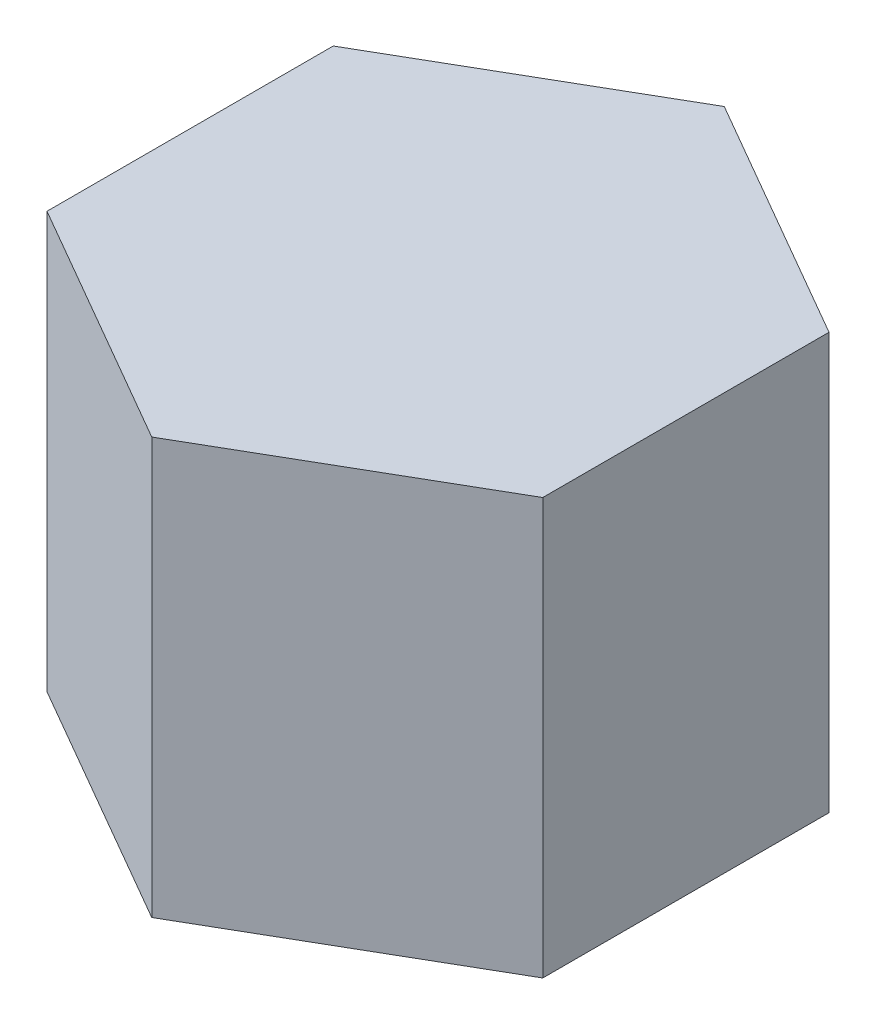
ISO-10303-21;
HEADER;
FILE_DESCRIPTION(('STEP AP214'),'2;1');
FILE_NAME('part.step','',(''),(''),'','','');
FILE_SCHEMA(('AUTOMOTIVE_DESIGN { 1 0 10303 214 1 1 1 1 }'));
ENDSEC;
DATA;
#1=APPLICATION_CONTEXT('core data for automotive mechanical design processes');
#2=APPLICATION_PROTOCOL_DEFINITION('international standard','automotive_design',2000,#1);
#3=PRODUCT_CONTEXT('',#1,'mechanical');
#4=PRODUCT('Part','Part','',(#3));
#5=PRODUCT_RELATED_PRODUCT_CATEGORY('part','',(#4));
#6=PRODUCT_DEFINITION_FORMATION('','',#4);
#7=PRODUCT_DEFINITION_CONTEXT('part definition',#1,'design');
#8=PRODUCT_DEFINITION('design','',#6,#7);
#9=PRODUCT_DEFINITION_SHAPE('','',#8);
#10=(LENGTH_UNIT() NAMED_UNIT(*) SI_UNIT(.MILLI.,.METRE.));
#11=(NAMED_UNIT(*) PLANE_ANGLE_UNIT() SI_UNIT($,.RADIAN.));
#12=(NAMED_UNIT(*) SI_UNIT($,.STERADIAN.) SOLID_ANGLE_UNIT());
#13=UNCERTAINTY_MEASURE_WITH_UNIT(LENGTH_MEASURE(1.E-05),#10,'distance_accuracy_value','');
#14=(GEOMETRIC_REPRESENTATION_CONTEXT(3) GLOBAL_UNCERTAINTY_ASSIGNED_CONTEXT((#13)) GLOBAL_UNIT_ASSIGNED_CONTEXT((#10,
#11,#12)) REPRESENTATION_CONTEXT('',''));
#15=CARTESIAN_POINT('',(0.,0.,0.));
#16=DIRECTION('',(0.,0.,1.));
#17=DIRECTION('',(1.,0.,0.));
#18=AXIS2_PLACEMENT_3D('',#15,#16,#17);
#19=CARTESIAN_POINT('',(203.839551417382,-147.556598747966,290.81594581671));
#20=DIRECTION('',(-0.500000000000096,0.,-0.866025403784383));
#21=DIRECTION('',(-0.866025403784383,0.,0.500000000000096));
#22=AXIS2_PLACEMENT_3D('',#19,#20,#21);
#23=PLANE('',#22);
#24=CARTESIAN_POINT('',(204.142660308706,-147.047793579175,290.64094581671));
#25=DIRECTION('',(-0.866025403784383,0.,0.500000000000096));
#26=VECTOR('',#25,1.);
#27=LINE('',#24,#26);
#28=CARTESIAN_POINT('',(204.142660308706,-147.047793579175,290.64094581671));
#29=VERTEX_POINT('',#28);
#30=CARTESIAN_POINT('',(203.839551417382,-147.047793579175,290.81594581671));
#31=VERTEX_POINT('',#30);
#32=EDGE_CURVE('E170',#29,#31,#27,.T.);
#33=ORIENTED_EDGE('',*,*,#32,.T.);
#34=CARTESIAN_POINT('',(203.839551417382,-147.556598747966,290.81594581671));
#35=DIRECTION('',(0.,1.,0.));
#36=VECTOR('',#35,1.);
#37=LINE('',#34,#36);
#38=CARTESIAN_POINT('',(203.839551417382,-147.556598747966,290.81594581671));
#39=VERTEX_POINT('',#38);
#40=EDGE_CURVE('E35',#39,#31,#37,.T.);
#41=ORIENTED_EDGE('',*,*,#40,.F.);
#42=CARTESIAN_POINT('',(204.142660308706,-147.556598747966,290.64094581671));
#43=DIRECTION('',(-0.866025403784383,0.,0.500000000000096));
#44=VECTOR('',#43,1.);
#45=LINE('',#42,#44);
#46=CARTESIAN_POINT('',(204.142660308706,-147.556598747966,290.64094581671));
#47=VERTEX_POINT('',#46);
#48=EDGE_CURVE('E159',#47,#39,#45,.T.);
#49=ORIENTED_EDGE('',*,*,#48,.F.);
#50=CARTESIAN_POINT('',(204.142660308706,-147.556598747966,290.64094581671));
#51=DIRECTION('',(0.,1.,0.));
#52=VECTOR('',#51,1.);
#53=LINE('',#50,#52);
#54=EDGE_CURVE('E10',#47,#29,#53,.T.);
#55=ORIENTED_EDGE('',*,*,#54,.T.);
#56=EDGE_LOOP('',(#33,#41,#49,#55));
#57=FACE_BOUND('',#56,.T.);
#58=ADVANCED_FACE('F16',(#57),#23,.F.);
#59=CARTESIAN_POINT('',(204.142660308706,-147.556598747966,291.594471220494));
#60=DIRECTION('',(-1.,0.,0.));
#61=DIRECTION('',(0.,-1.,0.));
#62=AXIS2_PLACEMENT_3D('',#59,#60,#61);
#63=PLANE('',#62);
#64=CARTESIAN_POINT('',(204.142660308706,-147.047793579175,290.29094581671));
#65=DIRECTION('',(0.,0.,1.));
#66=VECTOR('',#65,1.);
#67=LINE('',#64,#66);
#68=CARTESIAN_POINT('',(204.142660308706,-147.047793579175,290.29094581671));
#69=VERTEX_POINT('',#68);
#70=EDGE_CURVE('E167',#69,#29,#67,.T.);
#71=ORIENTED_EDGE('',*,*,#70,.T.);
#72=ORIENTED_EDGE('',*,*,#54,.F.);
#73=CARTESIAN_POINT('',(204.142660308706,-147.556598747966,290.29094581671));
#74=DIRECTION('',(0.,0.,1.));
#75=VECTOR('',#74,1.);
#76=LINE('',#73,#75);
#77=CARTESIAN_POINT('',(204.142660308706,-147.556598747966,290.29094581671));
#78=VERTEX_POINT('',#77);
#79=EDGE_CURVE('E156',#78,#47,#76,.T.);
#80=ORIENTED_EDGE('',*,*,#79,.F.);
#81=CARTESIAN_POINT('',(204.142660308706,-147.556598747966,290.29094581671));
#82=DIRECTION('',(0.,1.,0.));
#83=VECTOR('',#82,1.);
#84=LINE('',#81,#83);
#85=EDGE_CURVE('E27',#78,#69,#84,.T.);
#86=ORIENTED_EDGE('',*,*,#85,.T.);
#87=EDGE_LOOP('',(#71,#72,#80,#86));
#88=FACE_BOUND('',#87,.T.);
#89=ADVANCED_FACE('F189',(#88),#63,.F.);
#90=CARTESIAN_POINT('',(204.142660308706,-147.556598747966,290.29094581671));
#91=DIRECTION('',(-0.500000000000028,0.,0.866025403784422));
#92=DIRECTION('',(0.866025403784423,0.,0.500000000000028));
#93=AXIS2_PLACEMENT_3D('',#90,#91,#92);
#94=PLANE('',#93);
#95=CARTESIAN_POINT('',(203.839551417381,-147.047793579175,290.11594581671));
#96=DIRECTION('',(0.866025403784422,0.,0.500000000000028));
#97=VECTOR('',#96,1.);
#98=LINE('',#95,#97);
#99=CARTESIAN_POINT('',(203.839551417382,-147.047793579175,290.11594581671));
#100=VERTEX_POINT('',#99);
#101=EDGE_CURVE('E163',#100,#69,#98,.T.);
#102=ORIENTED_EDGE('',*,*,#101,.T.);
#103=ORIENTED_EDGE('',*,*,#85,.F.);
#104=CARTESIAN_POINT('',(203.839551417381,-147.556598747966,290.11594581671));
#105=DIRECTION('',(0.866025403784422,0.,0.500000000000028));
#106=VECTOR('',#105,1.);
#107=LINE('',#104,#106);
#108=CARTESIAN_POINT('',(203.839551417382,-147.556598747966,290.11594581671));
#109=VERTEX_POINT('',#108);
#110=EDGE_CURVE('E106',#109,#78,#107,.T.);
#111=ORIENTED_EDGE('',*,*,#110,.F.);
#112=CARTESIAN_POINT('',(203.839551417381,-147.556598747966,290.11594581671));
#113=DIRECTION('',(0.,1.,0.));
#114=VECTOR('',#113,1.);
#115=LINE('',#112,#114);
#116=EDGE_CURVE('E94',#109,#100,#115,.T.);
#117=ORIENTED_EDGE('',*,*,#116,.T.);
#118=EDGE_LOOP('',(#102,#103,#111,#117));
#119=FACE_BOUND('',#118,.T.);
#120=ADVANCED_FACE('F198',(#119),#94,.F.);
#121=CARTESIAN_POINT('',(203.839551417382,-147.556598747966,290.11594581671));
#122=DIRECTION('',(0.500000000000062,0.,0.866025403784403));
#123=DIRECTION('',(0.866025403784403,0.,-0.500000000000062));
#124=AXIS2_PLACEMENT_3D('',#121,#122,#123);
#125=PLANE('',#124);
#126=CARTESIAN_POINT('',(203.536442526057,-147.047793579175,290.29094581671));
#127=DIRECTION('',(0.866025403784403,0.,-0.500000000000062));
#128=VECTOR('',#127,1.);
#129=LINE('',#126,#128);
#130=CARTESIAN_POINT('',(203.536442526057,-147.047793579175,290.29094581671));
#131=VERTEX_POINT('',#130);
#132=EDGE_CURVE('E162',#131,#100,#129,.T.);
#133=ORIENTED_EDGE('',*,*,#132,.T.);
#134=ORIENTED_EDGE('',*,*,#116,.F.);
#135=CARTESIAN_POINT('',(203.536442526057,-147.556598747966,290.29094581671));
#136=DIRECTION('',(0.866025403784403,0.,-0.500000000000062));
#137=VECTOR('',#136,1.);
#138=LINE('',#135,#137);
#139=CARTESIAN_POINT('',(203.536442526057,-147.556598747966,290.29094581671));
#140=VERTEX_POINT('',#139);
#141=EDGE_CURVE('E98',#140,#109,#138,.T.);
#142=ORIENTED_EDGE('',*,*,#141,.F.);
#143=CARTESIAN_POINT('',(203.536442526057,-147.556598747966,290.29094581671));
#144=DIRECTION('',(0.,1.,0.));
#145=VECTOR('',#144,1.);
#146=LINE('',#143,#145);
#147=EDGE_CURVE('E79',#140,#131,#146,.T.);
#148=ORIENTED_EDGE('',*,*,#147,.T.);
#149=EDGE_LOOP('',(#133,#134,#142,#148));
#150=FACE_BOUND('',#149,.T.);
#151=ADVANCED_FACE('F100',(#150),#125,.F.);
#152=CARTESIAN_POINT('',(203.536442526057,-147.556598747966,291.594471220494));
#153=DIRECTION('',(1.,0.,0.));
#154=DIRECTION('',(0.,1.,0.));
#155=AXIS2_PLACEMENT_3D('',#152,#153,#154);
#156=PLANE('',#155);
#157=CARTESIAN_POINT('',(203.536442526057,-147.047793579175,290.64094581671));
#158=DIRECTION('',(0.,0.,-1.));
#159=VECTOR('',#158,1.);
#160=LINE('',#157,#159);
#161=CARTESIAN_POINT('',(203.536442526057,-147.047793579175,290.64094581671));
#162=VERTEX_POINT('',#161);
#163=EDGE_CURVE('E88',#162,#131,#160,.T.);
#164=ORIENTED_EDGE('',*,*,#163,.T.);
#165=ORIENTED_EDGE('',*,*,#147,.F.);
#166=CARTESIAN_POINT('',(203.536442526057,-147.556598747966,290.64094581671));
#167=DIRECTION('',(0.,0.,-1.));
#168=VECTOR('',#167,1.);
#169=LINE('',#166,#168);
#170=CARTESIAN_POINT('',(203.536442526057,-147.556598747966,290.64094581671));
#171=VERTEX_POINT('',#170);
#172=EDGE_CURVE('E84',#171,#140,#169,.T.);
#173=ORIENTED_EDGE('',*,*,#172,.F.);
#174=CARTESIAN_POINT('',(203.536442526057,-147.556598747966,290.64094581671));
#175=DIRECTION('',(0.,1.,0.));
#176=VECTOR('',#175,1.);
#177=LINE('',#174,#176);
#178=EDGE_CURVE('E58',#171,#162,#177,.T.);
#179=ORIENTED_EDGE('',*,*,#178,.T.);
#180=EDGE_LOOP('',(#164,#165,#173,#179));
#181=FACE_BOUND('',#180,.T.);
#182=ADVANCED_FACE('F82',(#181),#156,.F.);
#183=CARTESIAN_POINT('',(203.536442526057,-147.556598747966,290.64094581671));
#184=DIRECTION('',(0.500000000000062,0.,-0.866025403784403));
#185=DIRECTION('',(-0.866025403784403,0.,-0.500000000000062));
#186=AXIS2_PLACEMENT_3D('',#183,#184,#185);
#187=PLANE('',#186);
#188=CARTESIAN_POINT('',(203.839551417382,-147.047793579175,290.81594581671));
#189=DIRECTION('',(-0.866025403784403,0.,-0.500000000000062));
#190=VECTOR('',#189,1.);
#191=LINE('',#188,#190);
#192=EDGE_CURVE('E160',#31,#162,#191,.T.);
#193=ORIENTED_EDGE('',*,*,#192,.T.);
#194=ORIENTED_EDGE('',*,*,#178,.F.);
#195=CARTESIAN_POINT('',(203.839551417382,-147.556598747966,290.81594581671));
#196=DIRECTION('',(-0.866025403784403,0.,-0.500000000000062));
#197=VECTOR('',#196,1.);
#198=LINE('',#195,#197);
#199=EDGE_CURVE('E112',#39,#171,#198,.T.);
#200=ORIENTED_EDGE('',*,*,#199,.F.);
#201=ORIENTED_EDGE('',*,*,#40,.T.);
#202=EDGE_LOOP('',(#193,#194,#200,#201));
#203=FACE_BOUND('',#202,.T.);
#204=ADVANCED_FACE('F131',(#203),#187,.F.);
#205=CARTESIAN_POINT('',(206.491105863044,-147.556598747966,291.594471220494));
#206=DIRECTION('',(0.,1.,0.));
#207=DIRECTION('',(-1.,0.,0.));
#208=AXIS2_PLACEMENT_3D('',#205,#206,#207);
#209=PLANE('',#208);
#210=ORIENTED_EDGE('',*,*,#48,.T.);
#211=ORIENTED_EDGE('',*,*,#199,.T.);
#212=ORIENTED_EDGE('',*,*,#172,.T.);
#213=ORIENTED_EDGE('',*,*,#141,.T.);
#214=ORIENTED_EDGE('',*,*,#110,.T.);
#215=ORIENTED_EDGE('',*,*,#79,.T.);
#216=EDGE_LOOP('',(#210,#211,#212,#213,#214,#215));
#217=FACE_BOUND('',#216,.T.);
#218=ADVANCED_FACE('F111',(#217),#209,.F.);
#219=CARTESIAN_POINT('',(206.491105863044,-147.047793579175,291.594471220494));
#220=DIRECTION('',(0.,1.,0.));
#221=DIRECTION('',(-1.,0.,0.));
#222=AXIS2_PLACEMENT_3D('',#219,#220,#221);
#223=PLANE('',#222);
#224=ORIENTED_EDGE('',*,*,#32,.F.);
#225=ORIENTED_EDGE('',*,*,#70,.F.);
#226=ORIENTED_EDGE('',*,*,#101,.F.);
#227=ORIENTED_EDGE('',*,*,#132,.F.);
#228=ORIENTED_EDGE('',*,*,#163,.F.);
#229=ORIENTED_EDGE('',*,*,#192,.F.);
#230=EDGE_LOOP('',(#224,#225,#226,#227,#228,#229));
#231=FACE_BOUND('',#230,.T.);
#232=ADVANCED_FACE('F130',(#231),#223,.T.);
#233=CLOSED_SHELL('',(#58,#89,#120,#151,#182,#204,#218,#232));
#234=MANIFOLD_SOLID_BREP('B1',#233);
#235=ADVANCED_BREP_SHAPE_REPRESENTATION('',(#18,#234),#14);
#236=SHAPE_DEFINITION_REPRESENTATION(#9,#235);
ENDSEC;
END-ISO-10303-21;
